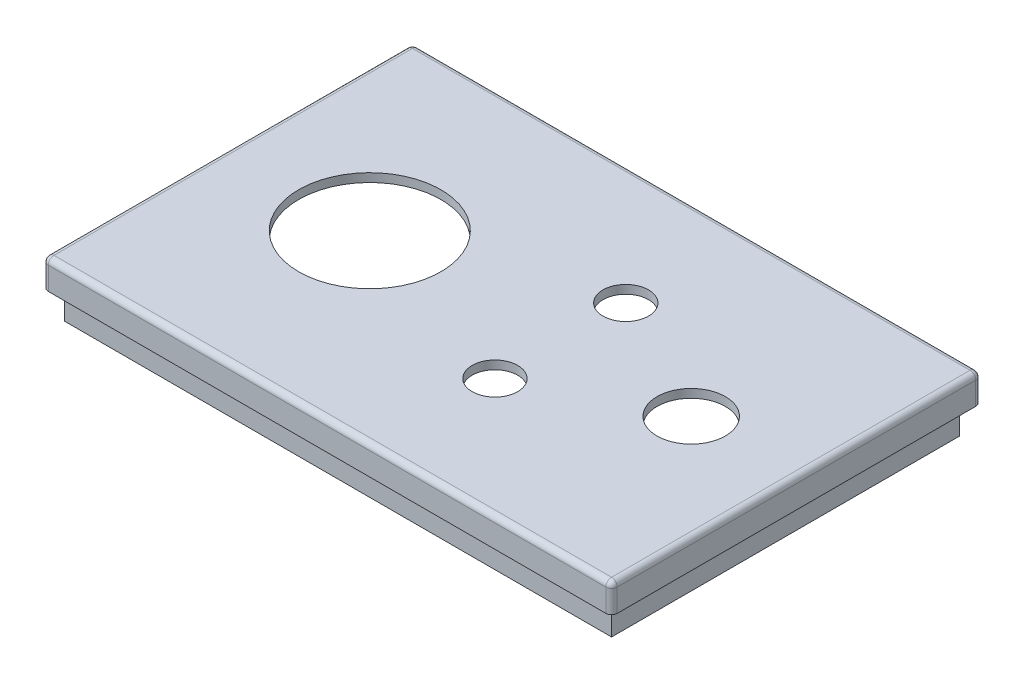
ISO-10303-21;
HEADER;
FILE_DESCRIPTION(('STEP AP214'),'2;1');
FILE_NAME('part.step','',(''),(''),'','','');
FILE_SCHEMA(('AUTOMOTIVE_DESIGN { 1 0 10303 214 1 1 1 1 }'));
ENDSEC;
DATA;
#1=APPLICATION_CONTEXT('core data for automotive mechanical design processes');
#2=APPLICATION_PROTOCOL_DEFINITION('international standard','automotive_design',2000,#1);
#3=PRODUCT_CONTEXT('',#1,'mechanical');
#4=PRODUCT('Part','Part','',(#3));
#5=PRODUCT_RELATED_PRODUCT_CATEGORY('part','',(#4));
#6=PRODUCT_DEFINITION_FORMATION('','',#4);
#7=PRODUCT_DEFINITION_CONTEXT('part definition',#1,'design');
#8=PRODUCT_DEFINITION('design','',#6,#7);
#9=PRODUCT_DEFINITION_SHAPE('','',#8);
#10=(LENGTH_UNIT() NAMED_UNIT(*) SI_UNIT(.MILLI.,.METRE.));
#11=(NAMED_UNIT(*) PLANE_ANGLE_UNIT() SI_UNIT($,.RADIAN.));
#12=(NAMED_UNIT(*) SI_UNIT($,.STERADIAN.) SOLID_ANGLE_UNIT());
#13=UNCERTAINTY_MEASURE_WITH_UNIT(LENGTH_MEASURE(1.E-05),#10,'distance_accuracy_value','');
#14=(GEOMETRIC_REPRESENTATION_CONTEXT(3) GLOBAL_UNCERTAINTY_ASSIGNED_CONTEXT((#13)) GLOBAL_UNIT_ASSIGNED_CONTEXT((#10,
#11,#12)) REPRESENTATION_CONTEXT('',''));
#15=CARTESIAN_POINT('',(0.,0.,0.));
#16=DIRECTION('',(0.,0.,1.));
#17=DIRECTION('',(1.,0.,0.));
#18=AXIS2_PLACEMENT_3D('',#15,#16,#17);
#19=CARTESIAN_POINT('',(0.,70.,0.));
#20=DIRECTION('',(0.,1.,0.));
#21=DIRECTION('',(0.,0.,1.));
#22=AXIS2_PLACEMENT_3D('',#19,#20,#21);
#23=PLANE('',#22);
#24=DIRECTION('',(-1.,0.,0.));
#25=VECTOR('',#24,1.);
#26=CARTESIAN_POINT('',(-47.0604562737643,70.,-39.1555133079848));
#27=LINE('',#26,#25);
#28=CARTESIAN_POINT('',(47.5395437262358,70.,-39.1555133079848));
#29=VERTEX_POINT('',#28);
#30=CARTESIAN_POINT('',(-45.0604562737643,70.,-39.1555133079848));
#31=VERTEX_POINT('',#30);
#32=EDGE_CURVE('E208',#29,#31,#27,.T.);
#33=ORIENTED_EDGE('',*,*,#32,.T.);
#34=DIRECTION('',(0.,0.,1.));
#35=VECTOR('',#34,1.);
#36=CARTESIAN_POINT('',(-45.0604562737643,70.,-41.1555133079848));
#37=LINE('',#36,#35);
#38=CARTESIAN_POINT('',(-45.0604562737643,70.,18.4444866920152));
#39=VERTEX_POINT('',#38);
#40=EDGE_CURVE('E196',#31,#39,#37,.T.);
#41=ORIENTED_EDGE('',*,*,#40,.T.);
#42=DIRECTION('',(1.,0.,0.));
#43=VECTOR('',#42,1.);
#44=CARTESIAN_POINT('',(-47.0604562737643,70.,18.4444866920152));
#45=LINE('',#44,#43);
#46=CARTESIAN_POINT('',(47.5395437262358,70.,18.4444866920152));
#47=VERTEX_POINT('',#46);
#48=EDGE_CURVE('E202',#39,#47,#45,.T.);
#49=ORIENTED_EDGE('',*,*,#48,.T.);
#50=DIRECTION('',(0.,0.,-1.));
#51=VECTOR('',#50,1.);
#52=CARTESIAN_POINT('',(47.5395437262358,70.,-41.1555133079848));
#53=LINE('',#52,#51);
#54=EDGE_CURVE('E205',#47,#29,#53,.T.);
#55=ORIENTED_EDGE('',*,*,#54,.T.);
#56=EDGE_LOOP('',(#33,#41,#49,#55));
#57=FACE_BOUND('',#56,.T.);
#58=DIRECTION('',(0.,0.,-1.));
#59=VECTOR('',#58,1.);
#60=CARTESIAN_POINT('',(-46.8604562737643,70.,20.2444866920152));
#61=LINE('',#60,#59);
#62=CARTESIAN_POINT('',(-46.8604562737643,70.,20.2444866920152));
#63=VERTEX_POINT('',#62);
#64=CARTESIAN_POINT('',(-46.8604562737643,70.,-40.9555133079848));
#65=VERTEX_POINT('',#64);
#66=EDGE_CURVE('E191',#63,#65,#61,.T.);
#67=ORIENTED_EDGE('',*,*,#66,.T.);
#68=DIRECTION('',(1.,0.,0.));
#69=VECTOR('',#68,1.);
#70=CARTESIAN_POINT('',(-46.8604562737643,70.,-40.9555133079848));
#71=LINE('',#70,#69);
#72=CARTESIAN_POINT('',(49.3395437262358,70.,-40.9555133079848));
#73=VERTEX_POINT('',#72);
#74=EDGE_CURVE('E166',#65,#73,#71,.T.);
#75=ORIENTED_EDGE('',*,*,#74,.T.);
#76=DIRECTION('',(0.,0.,1.));
#77=VECTOR('',#76,1.);
#78=CARTESIAN_POINT('',(49.3395437262358,70.,20.2444866920152));
#79=LINE('',#78,#77);
#80=CARTESIAN_POINT('',(49.3395437262358,70.,20.2444866920152));
#81=VERTEX_POINT('',#80);
#82=EDGE_CURVE('E50',#73,#81,#79,.T.);
#83=ORIENTED_EDGE('',*,*,#82,.T.);
#84=DIRECTION('',(-1.,0.,0.));
#85=VECTOR('',#84,1.);
#86=CARTESIAN_POINT('',(-46.8604562737643,70.,20.2444866920152));
#87=LINE('',#86,#85);
#88=EDGE_CURVE('E184',#81,#63,#87,.T.);
#89=ORIENTED_EDGE('',*,*,#88,.T.);
#90=EDGE_LOOP('',(#67,#75,#83,#89));
#91=FACE_BOUND('',#90,.T.);
#92=ADVANCED_FACE('F33',(#57,#91),#23,.F.);
#93=CARTESIAN_POINT('',(0.,75.,0.));
#94=DIRECTION('',(0.,1.,0.));
#95=DIRECTION('',(0.,0.,1.));
#96=AXIS2_PLACEMENT_3D('',#93,#94,#95);
#97=PLANE('',#96);
#98=CARTESIAN_POINT('',(-47.7604562737643,75.,21.1444866920152));
#99=DIRECTION('',(0.,1.,0.));
#100=DIRECTION('',(0.,0.,1.));
#101=AXIS2_PLACEMENT_3D('',#98,#99,#100);
#102=CIRCLE('',#101,1.);
#103=CARTESIAN_POINT('',(-47.7604562737643,75.,22.1444866920152));
#104=VERTEX_POINT('',#103);
#105=CARTESIAN_POINT('',(-48.7604562737643,75.,21.1444866920152));
#106=VERTEX_POINT('',#105);
#107=EDGE_CURVE('E37',#104,#106,#102,.F.);
#108=ORIENTED_EDGE('',*,*,#107,.T.);
#109=DIRECTION('',(0.,0.,1.));
#110=VECTOR('',#109,1.);
#111=CARTESIAN_POINT('',(-48.7604562737643,75.,-42.8555133079848));
#112=LINE('',#111,#110);
#113=CARTESIAN_POINT('',(-48.7604562737643,75.,-41.8555133079848));
#114=VERTEX_POINT('',#113);
#115=EDGE_CURVE('E327',#114,#106,#112,.T.);
#116=ORIENTED_EDGE('',*,*,#115,.F.);
#117=CARTESIAN_POINT('',(-47.7604562737643,75.,-41.8555133079848));
#118=DIRECTION('',(0.,1.,0.));
#119=DIRECTION('',(0.,0.,1.));
#120=AXIS2_PLACEMENT_3D('',#117,#118,#119);
#121=CIRCLE('',#120,1.);
#122=CARTESIAN_POINT('',(-47.7604562737643,75.,-42.8555133079848));
#123=VERTEX_POINT('',#122);
#124=EDGE_CURVE('E330',#114,#123,#121,.F.);
#125=ORIENTED_EDGE('',*,*,#124,.T.);
#126=DIRECTION('',(-1.,0.,0.));
#127=VECTOR('',#126,1.);
#128=CARTESIAN_POINT('',(-48.7604562737643,75.,-42.8555133079848));
#129=LINE('',#128,#127);
#130=CARTESIAN_POINT('',(50.2395437262357,75.,-42.8555133079848));
#131=VERTEX_POINT('',#130);
#132=EDGE_CURVE('E291',#131,#123,#129,.T.);
#133=ORIENTED_EDGE('',*,*,#132,.F.);
#134=CARTESIAN_POINT('',(50.2395437262357,75.,-41.8555133079848));
#135=DIRECTION('',(0.,1.,0.));
#136=DIRECTION('',(0.,0.,1.));
#137=AXIS2_PLACEMENT_3D('',#134,#135,#136);
#138=CIRCLE('',#137,1.);
#139=CARTESIAN_POINT('',(51.2395437262357,75.,-41.8555133079848));
#140=VERTEX_POINT('',#139);
#141=EDGE_CURVE('E11',#131,#140,#138,.F.);
#142=ORIENTED_EDGE('',*,*,#141,.T.);
#143=DIRECTION('',(0.,0.,-1.));
#144=VECTOR('',#143,1.);
#145=CARTESIAN_POINT('',(51.2395437262357,75.,-42.8555133079848));
#146=LINE('',#145,#144);
#147=CARTESIAN_POINT('',(51.2395437262358,75.,21.1444866920152));
#148=VERTEX_POINT('',#147);
#149=EDGE_CURVE('E325',#148,#140,#146,.T.);
#150=ORIENTED_EDGE('',*,*,#149,.F.);
#151=CARTESIAN_POINT('',(50.2395437262358,75.,21.1444866920152));
#152=DIRECTION('',(0.,1.,0.));
#153=DIRECTION('',(0.,0.,1.));
#154=AXIS2_PLACEMENT_3D('',#151,#152,#153);
#155=CIRCLE('',#154,1.);
#156=CARTESIAN_POINT('',(50.2395437262358,75.,22.1444866920152));
#157=VERTEX_POINT('',#156);
#158=EDGE_CURVE('E42',#148,#157,#155,.F.);
#159=ORIENTED_EDGE('',*,*,#158,.T.);
#160=DIRECTION('',(1.,0.,0.));
#161=VECTOR('',#160,1.);
#162=CARTESIAN_POINT('',(-48.7604562737643,75.,22.1444866920152));
#163=LINE('',#162,#161);
#164=EDGE_CURVE('E333',#104,#157,#163,.T.);
#165=ORIENTED_EDGE('',*,*,#164,.F.);
#166=EDGE_LOOP('',(#108,#116,#125,#133,#142,#150,#159,#165));
#167=FACE_BOUND('',#166,.T.);
#168=DIRECTION('',(-1.,0.,0.));
#169=VECTOR('',#168,1.);
#170=CARTESIAN_POINT('',(-46.8604562737643,75.,20.2444866920152));
#171=LINE('',#170,#169);
#172=CARTESIAN_POINT('',(49.3395437262358,75.,20.2444866920152));
#173=VERTEX_POINT('',#172);
#174=CARTESIAN_POINT('',(-46.8604562737643,75.,20.2444866920152));
#175=VERTEX_POINT('',#174);
#176=EDGE_CURVE('E172',#173,#175,#171,.T.);
#177=ORIENTED_EDGE('',*,*,#176,.F.);
#178=DIRECTION('',(0.,0.,1.));
#179=VECTOR('',#178,1.);
#180=CARTESIAN_POINT('',(49.3395437262358,75.,20.2444866920152));
#181=LINE('',#180,#179);
#182=CARTESIAN_POINT('',(49.3395437262358,75.,-40.9555133079848));
#183=VERTEX_POINT('',#182);
#184=EDGE_CURVE('E180',#183,#173,#181,.T.);
#185=ORIENTED_EDGE('',*,*,#184,.F.);
#186=DIRECTION('',(1.,0.,0.));
#187=VECTOR('',#186,1.);
#188=CARTESIAN_POINT('',(-46.8604562737643,75.,-40.9555133079848));
#189=LINE('',#188,#187);
#190=CARTESIAN_POINT('',(-46.8604562737643,75.,-40.9555133079848));
#191=VERTEX_POINT('',#190);
#192=EDGE_CURVE('E164',#191,#183,#189,.T.);
#193=ORIENTED_EDGE('',*,*,#192,.F.);
#194=DIRECTION('',(0.,0.,-1.));
#195=VECTOR('',#194,1.);
#196=CARTESIAN_POINT('',(-46.8604562737643,75.,20.2444866920152));
#197=LINE('',#196,#195);
#198=EDGE_CURVE('E177',#175,#191,#197,.T.);
#199=ORIENTED_EDGE('',*,*,#198,.F.);
#200=EDGE_LOOP('',(#177,#185,#193,#199));
#201=FACE_BOUND('',#200,.T.);
#202=ADVANCED_FACE('F35',(#167,#201),#97,.F.);
#203=CARTESIAN_POINT('',(-48.7604562737643,80.,22.1444866920152));
#204=DIRECTION('',(0.,0.,-1.));
#205=DIRECTION('',(-1.,0.,0.));
#206=AXIS2_PLACEMENT_3D('',#203,#204,#205);
#207=PLANE('',#206);
#208=DIRECTION('',(0.,-1.,0.));
#209=VECTOR('',#208,1.);
#210=CARTESIAN_POINT('',(-47.7604562737643,80.,22.1444866920152));
#211=LINE('',#210,#209);
#212=CARTESIAN_POINT('',(-47.7604562737643,79.,22.1444866920152));
#213=VERTEX_POINT('',#212);
#214=EDGE_CURVE('E284',#213,#104,#211,.T.);
#215=ORIENTED_EDGE('',*,*,#214,.T.);
#216=ORIENTED_EDGE('',*,*,#164,.T.);
#217=DIRECTION('',(0.,-1.,0.));
#218=VECTOR('',#217,1.);
#219=CARTESIAN_POINT('',(50.2395437262358,80.,22.1444866920152));
#220=LINE('',#219,#218);
#221=CARTESIAN_POINT('',(50.2395437262358,79.,22.1444866920152));
#222=VERTEX_POINT('',#221);
#223=EDGE_CURVE('E289',#157,#222,#220,.F.);
#224=ORIENTED_EDGE('',*,*,#223,.T.);
#225=DIRECTION('',(1.,0.,0.));
#226=VECTOR('',#225,1.);
#227=CARTESIAN_POINT('',(-48.7604562737643,79.,22.1444866920152));
#228=LINE('',#227,#226);
#229=EDGE_CURVE('E287',#222,#213,#228,.F.);
#230=ORIENTED_EDGE('',*,*,#229,.T.);
#231=EDGE_LOOP('',(#215,#216,#224,#230));
#232=FACE_BOUND('',#231,.T.);
#233=ADVANCED_FACE('F387',(#232),#207,.F.);
#234=CARTESIAN_POINT('',(0.,80.,0.));
#235=DIRECTION('',(0.,1.,0.));
#236=DIRECTION('',(0.,0.,1.));
#237=AXIS2_PLACEMENT_3D('',#234,#235,#236);
#238=PLANE('',#237);
#239=CARTESIAN_POINT('',(9.73954372623576,80.,1.14448669));
#240=DIRECTION('',(0.,1.,0.));
#241=DIRECTION('',(0.,0.,1.));
#242=AXIS2_PLACEMENT_3D('',#239,#240,#241);
#243=CIRCLE('',#242,4.);
#244=CARTESIAN_POINT('',(9.73954372623576,80.,5.14448669));
#245=VERTEX_POINT('',#244);
#246=EDGE_CURVE('E216',#245,#245,#243,.T.);
#247=ORIENTED_EDGE('',*,*,#246,.F.);
#248=EDGE_LOOP('',(#247));
#249=FACE_BOUND('',#248,.T.);
#250=CARTESIAN_POINT('',(9.73954372623576,80.,-21.85551331));
#251=DIRECTION('',(0.,1.,0.));
#252=DIRECTION('',(0.,0.,1.));
#253=AXIS2_PLACEMENT_3D('',#250,#251,#252);
#254=CIRCLE('',#253,4.);
#255=CARTESIAN_POINT('',(9.73954372623576,80.,-17.85551331));
#256=VERTEX_POINT('',#255);
#257=EDGE_CURVE('E211',#256,#256,#254,.T.);
#258=ORIENTED_EDGE('',*,*,#257,.F.);
#259=EDGE_LOOP('',(#258));
#260=FACE_BOUND('',#259,.T.);
#261=CARTESIAN_POINT('',(-23.7604562737643,80.,-10.3555133079848));
#262=DIRECTION('',(0.,1.,0.));
#263=DIRECTION('',(0.,0.,1.));
#264=AXIS2_PLACEMENT_3D('',#261,#262,#263);
#265=CIRCLE('',#264,12.5);
#266=CARTESIAN_POINT('',(-23.7604562737643,80.,2.14448669201522));
#267=VERTEX_POINT('',#266);
#268=EDGE_CURVE('E228',#267,#267,#265,.T.);
#269=ORIENTED_EDGE('',*,*,#268,.F.);
#270=EDGE_LOOP('',(#269));
#271=FACE_BOUND('',#270,.T.);
#272=CARTESIAN_POINT('',(32.7395437262358,80.,-10.3555133079848));
#273=DIRECTION('',(0.,1.,0.));
#274=DIRECTION('',(0.,0.,1.));
#275=AXIS2_PLACEMENT_3D('',#272,#273,#274);
#276=CIRCLE('',#275,5.99999999999999);
#277=CARTESIAN_POINT('',(32.7395437262358,80.,-4.35551330798479));
#278=VERTEX_POINT('',#277);
#279=EDGE_CURVE('E215',#278,#278,#276,.T.);
#280=ORIENTED_EDGE('',*,*,#279,.F.);
#281=EDGE_LOOP('',(#280));
#282=FACE_BOUND('',#281,.T.);
#283=DIRECTION('',(1.,0.,0.));
#284=VECTOR('',#283,1.);
#285=CARTESIAN_POINT('',(51.2395437262358,80.,21.1444866920152));
#286=LINE('',#285,#284);
#287=CARTESIAN_POINT('',(-47.7604562737643,80.,21.1444866920152));
#288=VERTEX_POINT('',#287);
#289=CARTESIAN_POINT('',(50.2395437262358,80.,21.1444866920152));
#290=VERTEX_POINT('',#289);
#291=EDGE_CURVE('E248',#288,#290,#286,.T.);
#292=ORIENTED_EDGE('',*,*,#291,.T.);
#293=DIRECTION('',(0.,0.,-1.));
#294=VECTOR('',#293,1.);
#295=CARTESIAN_POINT('',(50.2395437262357,80.,-42.8555133079848));
#296=LINE('',#295,#294);
#297=CARTESIAN_POINT('',(50.2395437262357,80.,-41.8555133079848));
#298=VERTEX_POINT('',#297);
#299=EDGE_CURVE('E259',#290,#298,#296,.T.);
#300=ORIENTED_EDGE('',*,*,#299,.T.);
#301=DIRECTION('',(-1.,0.,0.));
#302=VECTOR('',#301,1.);
#303=CARTESIAN_POINT('',(-48.7604562737643,80.,-41.8555133079848));
#304=LINE('',#303,#302);
#305=CARTESIAN_POINT('',(-47.7604562737643,80.,-41.8555133079848));
#306=VERTEX_POINT('',#305);
#307=EDGE_CURVE('E257',#298,#306,#304,.T.);
#308=ORIENTED_EDGE('',*,*,#307,.T.);
#309=DIRECTION('',(0.,0.,1.));
#310=VECTOR('',#309,1.);
#311=CARTESIAN_POINT('',(-47.7604562737643,80.,22.1444866920152));
#312=LINE('',#311,#310);
#313=EDGE_CURVE('E255',#306,#288,#312,.T.);
#314=ORIENTED_EDGE('',*,*,#313,.T.);
#315=EDGE_LOOP('',(#292,#300,#308,#314));
#316=FACE_BOUND('',#315,.T.);
#317=ADVANCED_FACE('F448',(#249,#260,#271,#282,#316),#238,.T.);
#318=CARTESIAN_POINT('',(-48.7604562737643,80.,-42.8555133079848));
#319=DIRECTION('',(1.,0.,0.));
#320=DIRECTION('',(0.,0.,-1.));
#321=AXIS2_PLACEMENT_3D('',#318,#319,#320);
#322=PLANE('',#321);
#323=DIRECTION('',(0.,-1.,0.));
#324=VECTOR('',#323,1.);
#325=CARTESIAN_POINT('',(-48.7604562737643,80.,-41.8555133079848));
#326=LINE('',#325,#324);
#327=CARTESIAN_POINT('',(-48.7604562737643,79.,-41.8555133079848));
#328=VERTEX_POINT('',#327);
#329=EDGE_CURVE('E277',#328,#114,#326,.T.);
#330=ORIENTED_EDGE('',*,*,#329,.T.);
#331=ORIENTED_EDGE('',*,*,#115,.T.);
#332=DIRECTION('',(0.,-1.,0.));
#333=VECTOR('',#332,1.);
#334=CARTESIAN_POINT('',(-48.7604562737643,80.,21.1444866920152));
#335=LINE('',#334,#333);
#336=CARTESIAN_POINT('',(-48.7604562737643,79.,21.1444866920152));
#337=VERTEX_POINT('',#336);
#338=EDGE_CURVE('E282',#106,#337,#335,.F.);
#339=ORIENTED_EDGE('',*,*,#338,.T.);
#340=DIRECTION('',(0.,0.,1.));
#341=VECTOR('',#340,1.);
#342=CARTESIAN_POINT('',(-48.7604562737643,79.,-42.8555133079848));
#343=LINE('',#342,#341);
#344=EDGE_CURVE('E280',#337,#328,#343,.F.);
#345=ORIENTED_EDGE('',*,*,#344,.T.);
#346=EDGE_LOOP('',(#330,#331,#339,#345));
#347=FACE_BOUND('',#346,.T.);
#348=ADVANCED_FACE('F346',(#347),#322,.F.);
#349=CARTESIAN_POINT('',(51.2395437262357,80.,-42.8555133079848));
#350=DIRECTION('',(-1.,0.,0.));
#351=DIRECTION('',(0.,0.,1.));
#352=AXIS2_PLACEMENT_3D('',#349,#350,#351);
#353=PLANE('',#352);
#354=DIRECTION('',(0.,-1.,0.));
#355=VECTOR('',#354,1.);
#356=CARTESIAN_POINT('',(51.2395437262358,80.,21.1444866920152));
#357=LINE('',#356,#355);
#358=CARTESIAN_POINT('',(51.2395437262358,79.,21.1444866920152));
#359=VERTEX_POINT('',#358);
#360=EDGE_CURVE('E267',#359,#148,#357,.T.);
#361=ORIENTED_EDGE('',*,*,#360,.T.);
#362=ORIENTED_EDGE('',*,*,#149,.T.);
#363=DIRECTION('',(0.,-1.,0.));
#364=VECTOR('',#363,1.);
#365=CARTESIAN_POINT('',(51.2395437262357,80.,-41.8555133079848));
#366=LINE('',#365,#364);
#367=CARTESIAN_POINT('',(51.2395437262357,79.,-41.8555133079848));
#368=VERTEX_POINT('',#367);
#369=EDGE_CURVE('E262',#140,#368,#366,.F.);
#370=ORIENTED_EDGE('',*,*,#369,.T.);
#371=DIRECTION('',(0.,0.,-1.));
#372=VECTOR('',#371,1.);
#373=CARTESIAN_POINT('',(51.2395437262358,79.,22.1444866920152));
#374=LINE('',#373,#372);
#375=EDGE_CURVE('E264',#368,#359,#374,.F.);
#376=ORIENTED_EDGE('',*,*,#375,.T.);
#377=EDGE_LOOP('',(#361,#362,#370,#376));
#378=FACE_BOUND('',#377,.T.);
#379=ADVANCED_FACE('F380',(#378),#353,.F.);
#380=CARTESIAN_POINT('',(-48.7604562737643,80.,-42.8555133079848));
#381=DIRECTION('',(0.,0.,1.));
#382=DIRECTION('',(1.,0.,0.));
#383=AXIS2_PLACEMENT_3D('',#380,#381,#382);
#384=PLANE('',#383);
#385=DIRECTION('',(0.,-1.,0.));
#386=VECTOR('',#385,1.);
#387=CARTESIAN_POINT('',(50.2395437262357,80.,-42.8555133079848));
#388=LINE('',#387,#386);
#389=CARTESIAN_POINT('',(50.2395437262357,79.,-42.8555133079848));
#390=VERTEX_POINT('',#389);
#391=EDGE_CURVE('E270',#390,#131,#388,.T.);
#392=ORIENTED_EDGE('',*,*,#391,.T.);
#393=ORIENTED_EDGE('',*,*,#132,.T.);
#394=DIRECTION('',(0.,-1.,0.));
#395=VECTOR('',#394,1.);
#396=CARTESIAN_POINT('',(-47.7604562737643,80.,-42.8555133079848));
#397=LINE('',#396,#395);
#398=CARTESIAN_POINT('',(-47.7604562737643,79.,-42.8555133079848));
#399=VERTEX_POINT('',#398);
#400=EDGE_CURVE('E275',#123,#399,#397,.F.);
#401=ORIENTED_EDGE('',*,*,#400,.T.);
#402=DIRECTION('',(-1.,0.,0.));
#403=VECTOR('',#402,1.);
#404=CARTESIAN_POINT('',(51.2395437262357,79.,-42.8555133079848));
#405=LINE('',#404,#403);
#406=EDGE_CURVE('E273',#399,#390,#405,.F.);
#407=ORIENTED_EDGE('',*,*,#406,.T.);
#408=EDGE_LOOP('',(#392,#393,#401,#407));
#409=FACE_BOUND('',#408,.T.);
#410=ADVANCED_FACE('F364',(#409),#384,.F.);
#411=CARTESIAN_POINT('',(0.,78.5,0.));
#412=DIRECTION('',(0.,1.,0.));
#413=DIRECTION('',(0.,0.,1.));
#414=AXIS2_PLACEMENT_3D('',#411,#412,#413);
#415=PLANE('',#414);
#416=CARTESIAN_POINT('',(9.73954372623576,78.5,1.14448669));
#417=DIRECTION('',(0.,1.,0.));
#418=DIRECTION('',(0.,0.,1.));
#419=AXIS2_PLACEMENT_3D('',#416,#417,#418);
#420=CIRCLE('',#419,4.);
#421=CARTESIAN_POINT('',(9.73954372623576,78.5,5.14448669));
#422=VERTEX_POINT('',#421);
#423=EDGE_CURVE('E212',#422,#422,#420,.T.);
#424=ORIENTED_EDGE('',*,*,#423,.T.);
#425=EDGE_LOOP('',(#424));
#426=FACE_BOUND('',#425,.T.);
#427=CARTESIAN_POINT('',(9.73954372623576,78.5,-21.85551331));
#428=DIRECTION('',(0.,1.,0.));
#429=DIRECTION('',(0.,0.,1.));
#430=AXIS2_PLACEMENT_3D('',#427,#428,#429);
#431=CIRCLE('',#430,4.);
#432=CARTESIAN_POINT('',(9.73954372623576,78.5,-17.85551331));
#433=VERTEX_POINT('',#432);
#434=EDGE_CURVE('E219',#433,#433,#431,.T.);
#435=ORIENTED_EDGE('',*,*,#434,.T.);
#436=EDGE_LOOP('',(#435));
#437=FACE_BOUND('',#436,.T.);
#438=CARTESIAN_POINT('',(-23.7604562737643,78.5,-10.3555133079848));
#439=DIRECTION('',(0.,1.,0.));
#440=DIRECTION('',(0.,0.,1.));
#441=AXIS2_PLACEMENT_3D('',#438,#439,#440);
#442=CIRCLE('',#441,12.5);
#443=CARTESIAN_POINT('',(-23.7604562737643,78.5,2.14448669201522));
#444=VERTEX_POINT('',#443);
#445=EDGE_CURVE('E224',#444,#444,#442,.T.);
#446=ORIENTED_EDGE('',*,*,#445,.T.);
#447=EDGE_LOOP('',(#446));
#448=FACE_BOUND('',#447,.T.);
#449=CARTESIAN_POINT('',(32.7395437262358,78.5,-10.3555133079848));
#450=DIRECTION('',(0.,1.,0.));
#451=DIRECTION('',(0.,0.,1.));
#452=AXIS2_PLACEMENT_3D('',#449,#450,#451);
#453=CIRCLE('',#452,5.99999999999999);
#454=CARTESIAN_POINT('',(32.7395437262358,78.5,-4.35551330798479));
#455=VERTEX_POINT('',#454);
#456=EDGE_CURVE('E231',#455,#455,#453,.T.);
#457=ORIENTED_EDGE('',*,*,#456,.T.);
#458=EDGE_LOOP('',(#457));
#459=FACE_BOUND('',#458,.T.);
#460=DIRECTION('',(-1.,0.,0.));
#461=VECTOR('',#460,1.);
#462=CARTESIAN_POINT('',(47.5395437262358,78.5,18.4444866920152));
#463=LINE('',#462,#461);
#464=CARTESIAN_POINT('',(47.5395437262358,78.5,18.4444866920152));
#465=VERTEX_POINT('',#464);
#466=CARTESIAN_POINT('',(-45.0604562737642,78.5,18.4444866920152));
#467=VERTEX_POINT('',#466);
#468=EDGE_CURVE('E246',#465,#467,#463,.T.);
#469=ORIENTED_EDGE('',*,*,#468,.T.);
#470=DIRECTION('',(0.,0.,-1.));
#471=VECTOR('',#470,1.);
#472=CARTESIAN_POINT('',(-45.0604562737642,78.5,-39.1555133079848));
#473=LINE('',#472,#471);
#474=CARTESIAN_POINT('',(-45.0604562737642,78.5,-39.1555133079848));
#475=VERTEX_POINT('',#474);
#476=EDGE_CURVE('E249',#467,#475,#473,.T.);
#477=ORIENTED_EDGE('',*,*,#476,.T.);
#478=DIRECTION('',(1.,0.,0.));
#479=VECTOR('',#478,1.);
#480=CARTESIAN_POINT('',(47.5395437262358,78.5,-39.1555133079848));
#481=LINE('',#480,#479);
#482=CARTESIAN_POINT('',(47.5395437262358,78.5,-39.1555133079848));
#483=VERTEX_POINT('',#482);
#484=EDGE_CURVE('E251',#475,#483,#481,.T.);
#485=ORIENTED_EDGE('',*,*,#484,.T.);
#486=DIRECTION('',(0.,0.,1.));
#487=VECTOR('',#486,1.);
#488=CARTESIAN_POINT('',(47.5395437262358,78.5,-39.1555133079848));
#489=LINE('',#488,#487);
#490=EDGE_CURVE('E244',#483,#465,#489,.T.);
#491=ORIENTED_EDGE('',*,*,#490,.T.);
#492=EDGE_LOOP('',(#469,#477,#485,#491));
#493=FACE_BOUND('',#492,.T.);
#494=ADVANCED_FACE('F432',(#426,#437,#448,#459,#493),#415,.F.);
#495=CARTESIAN_POINT('',(47.5395437262358,80.002,-39.1555133079848));
#496=DIRECTION('',(1.,0.,0.));
#497=DIRECTION('',(0.,0.,-1.));
#498=AXIS2_PLACEMENT_3D('',#495,#496,#497);
#499=PLANE('',#498);
#500=DIRECTION('',(0.,-1.,0.));
#501=VECTOR('',#500,1.);
#502=CARTESIAN_POINT('',(47.5395437262358,80.002,-39.1555133079848));
#503=LINE('',#502,#501);
#504=EDGE_CURVE('E242',#483,#29,#503,.T.);
#505=ORIENTED_EDGE('',*,*,#504,.T.);
#506=ORIENTED_EDGE('',*,*,#54,.F.);
#507=DIRECTION('',(0.,-1.,0.));
#508=VECTOR('',#507,1.);
#509=CARTESIAN_POINT('',(47.5395437262358,80.002,18.4444866920152));
#510=LINE('',#509,#508);
#511=EDGE_CURVE('E236',#465,#47,#510,.T.);
#512=ORIENTED_EDGE('',*,*,#511,.F.);
#513=ORIENTED_EDGE('',*,*,#490,.F.);
#514=EDGE_LOOP('',(#505,#506,#512,#513));
#515=FACE_BOUND('',#514,.T.);
#516=ADVANCED_FACE('F428',(#515),#499,.F.);
#517=CARTESIAN_POINT('',(47.5395437262358,80.002,-39.1555133079848));
#518=DIRECTION('',(0.,0.,-1.));
#519=DIRECTION('',(-1.,0.,0.));
#520=AXIS2_PLACEMENT_3D('',#517,#518,#519);
#521=PLANE('',#520);
#522=DIRECTION('',(0.,-1.,0.));
#523=VECTOR('',#522,1.);
#524=CARTESIAN_POINT('',(-45.0604562737642,80.002,-39.1555133079848));
#525=LINE('',#524,#523);
#526=EDGE_CURVE('E241',#475,#31,#525,.T.);
#527=ORIENTED_EDGE('',*,*,#526,.T.);
#528=ORIENTED_EDGE('',*,*,#32,.F.);
#529=ORIENTED_EDGE('',*,*,#504,.F.);
#530=ORIENTED_EDGE('',*,*,#484,.F.);
#531=EDGE_LOOP('',(#527,#528,#529,#530));
#532=FACE_BOUND('',#531,.T.);
#533=ADVANCED_FACE('F431',(#532),#521,.F.);
#534=CARTESIAN_POINT('',(-45.0604562737642,80.002,-39.1555133079848));
#535=DIRECTION('',(-1.,0.,0.));
#536=DIRECTION('',(0.,0.,1.));
#537=AXIS2_PLACEMENT_3D('',#534,#535,#536);
#538=PLANE('',#537);
#539=DIRECTION('',(0.,-1.,0.));
#540=VECTOR('',#539,1.);
#541=CARTESIAN_POINT('',(-45.0604562737642,80.002,18.4444866920152));
#542=LINE('',#541,#540);
#543=EDGE_CURVE('E238',#467,#39,#542,.T.);
#544=ORIENTED_EDGE('',*,*,#543,.T.);
#545=ORIENTED_EDGE('',*,*,#40,.F.);
#546=ORIENTED_EDGE('',*,*,#526,.F.);
#547=ORIENTED_EDGE('',*,*,#476,.F.);
#548=EDGE_LOOP('',(#544,#545,#546,#547));
#549=FACE_BOUND('',#548,.T.);
#550=ADVANCED_FACE('F437',(#549),#538,.F.);
#551=CARTESIAN_POINT('',(47.5395437262358,80.002,18.4444866920152));
#552=DIRECTION('',(0.,0.,1.));
#553=DIRECTION('',(1.,0.,0.));
#554=AXIS2_PLACEMENT_3D('',#551,#552,#553);
#555=PLANE('',#554);
#556=ORIENTED_EDGE('',*,*,#511,.T.);
#557=ORIENTED_EDGE('',*,*,#48,.F.);
#558=ORIENTED_EDGE('',*,*,#543,.F.);
#559=ORIENTED_EDGE('',*,*,#468,.F.);
#560=EDGE_LOOP('',(#556,#557,#558,#559));
#561=FACE_BOUND('',#560,.T.);
#562=ADVANCED_FACE('F434',(#561),#555,.F.);
#563=CARTESIAN_POINT('',(-47.7604562737643,80.,21.1444866920152));
#564=DIRECTION('',(0.,-1.,0.));
#565=DIRECTION('',(0.,0.,-1.));
#566=AXIS2_PLACEMENT_3D('',#563,#564,#565);
#567=CYLINDRICAL_SURFACE('',#566,1.);
#568=ORIENTED_EDGE('',*,*,#107,.F.);
#569=ORIENTED_EDGE('',*,*,#214,.F.);
#570=CARTESIAN_POINT('',(-47.7604562737643,79.,21.1444866920152));
#571=DIRECTION('',(0.,1.,0.));
#572=DIRECTION('',(0.,0.,1.));
#573=AXIS2_PLACEMENT_3D('',#570,#571,#572);
#574=CIRCLE('',#573,1.);
#575=EDGE_CURVE('E239',#337,#213,#574,.T.);
#576=ORIENTED_EDGE('',*,*,#575,.F.);
#577=ORIENTED_EDGE('',*,*,#338,.F.);
#578=EDGE_LOOP('',(#568,#569,#576,#577));
#579=FACE_BOUND('',#578,.T.);
#580=ADVANCED_FACE('F343',(#579),#567,.T.);
#581=CARTESIAN_POINT('',(-47.7604562737643,79.,0.));
#582=DIRECTION('',(0.,0.,-1.));
#583=DIRECTION('',(-1.,0.,0.));
#584=AXIS2_PLACEMENT_3D('',#581,#582,#583);
#585=CYLINDRICAL_SURFACE('',#584,1.);
#586=CARTESIAN_POINT('',(-47.7604562737643,79.,-41.8555133079848));
#587=DIRECTION('',(0.,0.,-1.));
#588=DIRECTION('',(-1.,0.,0.));
#589=AXIS2_PLACEMENT_3D('',#586,#587,#588);
#590=CIRCLE('',#589,1.);
#591=EDGE_CURVE('E316',#328,#306,#590,.T.);
#592=ORIENTED_EDGE('',*,*,#591,.F.);
#593=ORIENTED_EDGE('',*,*,#344,.F.);
#594=CARTESIAN_POINT('',(-47.7604562737643,79.,21.1444866920152));
#595=DIRECTION('',(0.,0.,1.));
#596=DIRECTION('',(1.,0.,0.));
#597=AXIS2_PLACEMENT_3D('',#594,#595,#596);
#598=CIRCLE('',#597,1.);
#599=EDGE_CURVE('E319',#288,#337,#598,.T.);
#600=ORIENTED_EDGE('',*,*,#599,.F.);
#601=ORIENTED_EDGE('',*,*,#313,.F.);
#602=EDGE_LOOP('',(#592,#593,#600,#601));
#603=FACE_BOUND('',#602,.T.);
#604=ADVANCED_FACE('F351',(#603),#585,.T.);
#605=CARTESIAN_POINT('',(-47.7604562737643,80.,-41.8555133079848));
#606=DIRECTION('',(0.,-1.,0.));
#607=DIRECTION('',(0.,0.,-1.));
#608=AXIS2_PLACEMENT_3D('',#605,#606,#607);
#609=CYLINDRICAL_SURFACE('',#608,1.);
#610=ORIENTED_EDGE('',*,*,#124,.F.);
#611=ORIENTED_EDGE('',*,*,#329,.F.);
#612=CARTESIAN_POINT('',(-47.7604562737643,79.,-41.8555133079848));
#613=DIRECTION('',(0.,1.,0.));
#614=DIRECTION('',(0.,0.,1.));
#615=AXIS2_PLACEMENT_3D('',#612,#613,#614);
#616=CIRCLE('',#615,1.);
#617=EDGE_CURVE('E313',#399,#328,#616,.T.);
#618=ORIENTED_EDGE('',*,*,#617,.F.);
#619=ORIENTED_EDGE('',*,*,#400,.F.);
#620=EDGE_LOOP('',(#610,#611,#618,#619));
#621=FACE_BOUND('',#620,.T.);
#622=ADVANCED_FACE('F361',(#621),#609,.T.);
#623=CARTESIAN_POINT('',(-47.7604562737643,79.,21.1444866920152));
#624=DIRECTION('',(-1.,0.,0.));
#625=DIRECTION('',(0.,0.,1.));
#626=AXIS2_PLACEMENT_3D('',#623,#624,#625);
#627=SPHERICAL_SURFACE('',#626,1.);
#628=ORIENTED_EDGE('',*,*,#599,.T.);
#629=ORIENTED_EDGE('',*,*,#575,.T.);
#630=CARTESIAN_POINT('',(-47.7604562737643,79.,21.1444866920152));
#631=DIRECTION('',(-1.,0.,0.));
#632=DIRECTION('',(0.,0.,1.));
#633=AXIS2_PLACEMENT_3D('',#630,#631,#632);
#634=CIRCLE('',#633,1.);
#635=EDGE_CURVE('E310',#288,#213,#634,.F.);
#636=ORIENTED_EDGE('',*,*,#635,.F.);
#637=EDGE_LOOP('',(#628,#629,#636));
#638=FACE_BOUND('',#637,.T.);
#639=ADVANCED_FACE('F393',(#638),#627,.T.);
#640=CARTESIAN_POINT('',(-47.7604562737643,79.,-41.8555133079848));
#641=DIRECTION('',(-1.,0.,0.));
#642=DIRECTION('',(0.,0.,1.));
#643=AXIS2_PLACEMENT_3D('',#640,#641,#642);
#644=SPHERICAL_SURFACE('',#643,1.);
#645=ORIENTED_EDGE('',*,*,#617,.T.);
#646=ORIENTED_EDGE('',*,*,#591,.T.);
#647=CARTESIAN_POINT('',(-47.7604562737643,79.,-41.8555133079848));
#648=DIRECTION('',(-1.,0.,0.));
#649=DIRECTION('',(0.,0.,1.));
#650=AXIS2_PLACEMENT_3D('',#647,#648,#649);
#651=CIRCLE('',#650,1.);
#652=EDGE_CURVE('E307',#399,#306,#651,.F.);
#653=ORIENTED_EDGE('',*,*,#652,.F.);
#654=EDGE_LOOP('',(#645,#646,#653));
#655=FACE_BOUND('',#654,.T.);
#656=ADVANCED_FACE('F357',(#655),#644,.T.);
#657=CARTESIAN_POINT('',(50.2395437262358,80.,21.1444866920152));
#658=DIRECTION('',(0.,-1.,0.));
#659=DIRECTION('',(0.,0.,-1.));
#660=AXIS2_PLACEMENT_3D('',#657,#658,#659);
#661=CYLINDRICAL_SURFACE('',#660,1.);
#662=ORIENTED_EDGE('',*,*,#158,.F.);
#663=ORIENTED_EDGE('',*,*,#360,.F.);
#664=CARTESIAN_POINT('',(50.2395437262358,79.,21.1444866920152));
#665=DIRECTION('',(0.,1.,0.));
#666=DIRECTION('',(0.,0.,1.));
#667=AXIS2_PLACEMENT_3D('',#664,#665,#666);
#668=CIRCLE('',#667,1.);
#669=EDGE_CURVE('E304',#222,#359,#668,.T.);
#670=ORIENTED_EDGE('',*,*,#669,.F.);
#671=ORIENTED_EDGE('',*,*,#223,.F.);
#672=EDGE_LOOP('',(#662,#663,#670,#671));
#673=FACE_BOUND('',#672,.T.);
#674=ADVANCED_FACE('F385',(#673),#661,.T.);
#675=CARTESIAN_POINT('',(0.,79.,21.1444866920152));
#676=DIRECTION('',(-1.,0.,0.));
#677=DIRECTION('',(0.,0.,1.));
#678=AXIS2_PLACEMENT_3D('',#675,#676,#677);
#679=CYLINDRICAL_SURFACE('',#678,1.);
#680=ORIENTED_EDGE('',*,*,#635,.T.);
#681=ORIENTED_EDGE('',*,*,#229,.F.);
#682=CARTESIAN_POINT('',(50.2395437262358,79.,21.1444866920152));
#683=DIRECTION('',(1.,0.,0.));
#684=DIRECTION('',(0.,0.,-1.));
#685=AXIS2_PLACEMENT_3D('',#682,#683,#684);
#686=CIRCLE('',#685,1.);
#687=EDGE_CURVE('E301',#290,#222,#686,.T.);
#688=ORIENTED_EDGE('',*,*,#687,.F.);
#689=ORIENTED_EDGE('',*,*,#291,.F.);
#690=EDGE_LOOP('',(#680,#681,#688,#689));
#691=FACE_BOUND('',#690,.T.);
#692=ADVANCED_FACE('F390',(#691),#679,.T.);
#693=CARTESIAN_POINT('',(0.,79.,-41.8555133079848));
#694=DIRECTION('',(1.,0.,0.));
#695=DIRECTION('',(0.,0.,-1.));
#696=AXIS2_PLACEMENT_3D('',#693,#694,#695);
#697=CYLINDRICAL_SURFACE('',#696,1.);
#698=ORIENTED_EDGE('',*,*,#652,.T.);
#699=ORIENTED_EDGE('',*,*,#307,.F.);
#700=CARTESIAN_POINT('',(50.2395437262357,79.,-41.8555133079848));
#701=DIRECTION('',(1.,0.,0.));
#702=DIRECTION('',(0.,0.,-1.));
#703=AXIS2_PLACEMENT_3D('',#700,#701,#702);
#704=CIRCLE('',#703,1.);
#705=EDGE_CURVE('E298',#390,#298,#704,.T.);
#706=ORIENTED_EDGE('',*,*,#705,.F.);
#707=ORIENTED_EDGE('',*,*,#406,.F.);
#708=EDGE_LOOP('',(#698,#699,#706,#707));
#709=FACE_BOUND('',#708,.T.);
#710=ADVANCED_FACE('F371',(#709),#697,.T.);
#711=CARTESIAN_POINT('',(50.2395437262357,80.,-41.8555133079848));
#712=DIRECTION('',(0.,-1.,0.));
#713=DIRECTION('',(0.,0.,-1.));
#714=AXIS2_PLACEMENT_3D('',#711,#712,#713);
#715=CYLINDRICAL_SURFACE('',#714,1.);
#716=ORIENTED_EDGE('',*,*,#141,.F.);
#717=ORIENTED_EDGE('',*,*,#391,.F.);
#718=CARTESIAN_POINT('',(50.2395437262357,79.,-41.8555133079848));
#719=DIRECTION('',(0.,1.,0.));
#720=DIRECTION('',(0.,0.,1.));
#721=AXIS2_PLACEMENT_3D('',#718,#719,#720);
#722=CIRCLE('',#721,1.);
#723=EDGE_CURVE('E295',#368,#390,#722,.T.);
#724=ORIENTED_EDGE('',*,*,#723,.F.);
#725=ORIENTED_EDGE('',*,*,#369,.F.);
#726=EDGE_LOOP('',(#716,#717,#724,#725));
#727=FACE_BOUND('',#726,.T.);
#728=ADVANCED_FACE('F367',(#727),#715,.T.);
#729=CARTESIAN_POINT('',(50.2395437262358,79.,21.1444866920152));
#730=DIRECTION('',(0.,0.,1.));
#731=DIRECTION('',(1.,0.,0.));
#732=AXIS2_PLACEMENT_3D('',#729,#730,#731);
#733=SPHERICAL_SURFACE('',#732,1.);
#734=ORIENTED_EDGE('',*,*,#687,.T.);
#735=ORIENTED_EDGE('',*,*,#669,.T.);
#736=CARTESIAN_POINT('',(50.2395437262358,79.,21.1444866920152));
#737=DIRECTION('',(0.,0.,1.));
#738=DIRECTION('',(0.,-1.,0.));
#739=AXIS2_PLACEMENT_3D('',#736,#737,#738);
#740=CIRCLE('',#739,1.);
#741=EDGE_CURVE('E293',#290,#359,#740,.F.);
#742=ORIENTED_EDGE('',*,*,#741,.F.);
#743=EDGE_LOOP('',(#734,#735,#742));
#744=FACE_BOUND('',#743,.T.);
#745=ADVANCED_FACE('F464',(#744),#733,.T.);
#746=CARTESIAN_POINT('',(50.2395437262357,79.,-41.8555133079848));
#747=DIRECTION('',(0.,0.,-1.));
#748=DIRECTION('',(-1.,0.,0.));
#749=AXIS2_PLACEMENT_3D('',#746,#747,#748);
#750=SPHERICAL_SURFACE('',#749,1.);
#751=ORIENTED_EDGE('',*,*,#723,.T.);
#752=ORIENTED_EDGE('',*,*,#705,.T.);
#753=CARTESIAN_POINT('',(50.2395437262357,79.,-41.8555133079848));
#754=DIRECTION('',(0.,0.,-1.));
#755=DIRECTION('',(-1.,0.,0.));
#756=AXIS2_PLACEMENT_3D('',#753,#754,#755);
#757=CIRCLE('',#756,1.);
#758=EDGE_CURVE('E227',#368,#298,#757,.F.);
#759=ORIENTED_EDGE('',*,*,#758,.F.);
#760=EDGE_LOOP('',(#751,#752,#759));
#761=FACE_BOUND('',#760,.T.);
#762=ADVANCED_FACE('F374',(#761),#750,.T.);
#763=CARTESIAN_POINT('',(50.2395437262358,79.,0.));
#764=DIRECTION('',(0.,0.,1.));
#765=DIRECTION('',(1.,0.,0.));
#766=AXIS2_PLACEMENT_3D('',#763,#764,#765);
#767=CYLINDRICAL_SURFACE('',#766,1.);
#768=ORIENTED_EDGE('',*,*,#741,.T.);
#769=ORIENTED_EDGE('',*,*,#375,.F.);
#770=ORIENTED_EDGE('',*,*,#758,.T.);
#771=ORIENTED_EDGE('',*,*,#299,.F.);
#772=EDGE_LOOP('',(#768,#769,#770,#771));
#773=FACE_BOUND('',#772,.T.);
#774=ADVANCED_FACE('F377',(#773),#767,.T.);
#775=CARTESIAN_POINT('',(32.7395437262358,78.5,-10.3555133079848));
#776=DIRECTION('',(0.,1.,0.));
#777=DIRECTION('',(0.,0.,1.));
#778=AXIS2_PLACEMENT_3D('',#775,#776,#777);
#779=CYLINDRICAL_SURFACE('',#778,5.99999999999999);
#780=ORIENTED_EDGE('',*,*,#456,.F.);
#781=EDGE_LOOP('',(#780));
#782=FACE_BOUND('',#781,.T.);
#783=ORIENTED_EDGE('',*,*,#279,.T.);
#784=EDGE_LOOP('',(#783));
#785=FACE_BOUND('',#784,.T.);
#786=ADVANCED_FACE('F423',(#782,#785),#779,.F.);
#787=CARTESIAN_POINT('',(-23.7604562737643,78.5,-10.3555133079848));
#788=DIRECTION('',(0.,1.,0.));
#789=DIRECTION('',(0.,0.,1.));
#790=AXIS2_PLACEMENT_3D('',#787,#788,#789);
#791=CYLINDRICAL_SURFACE('',#790,12.5);
#792=ORIENTED_EDGE('',*,*,#445,.F.);
#793=EDGE_LOOP('',(#792));
#794=FACE_BOUND('',#793,.T.);
#795=ORIENTED_EDGE('',*,*,#268,.T.);
#796=EDGE_LOOP('',(#795));
#797=FACE_BOUND('',#796,.T.);
#798=ADVANCED_FACE('F419',(#794,#797),#791,.F.);
#799=CARTESIAN_POINT('',(9.73954372623576,78.5,-21.85551331));
#800=DIRECTION('',(0.,1.,0.));
#801=DIRECTION('',(0.,0.,1.));
#802=AXIS2_PLACEMENT_3D('',#799,#800,#801);
#803=CYLINDRICAL_SURFACE('',#802,4.);
#804=ORIENTED_EDGE('',*,*,#434,.F.);
#805=EDGE_LOOP('',(#804));
#806=FACE_BOUND('',#805,.T.);
#807=ORIENTED_EDGE('',*,*,#257,.T.);
#808=EDGE_LOOP('',(#807));
#809=FACE_BOUND('',#808,.T.);
#810=ADVANCED_FACE('F415',(#806,#809),#803,.F.);
#811=CARTESIAN_POINT('',(9.73954372623576,78.5,1.14448669));
#812=DIRECTION('',(0.,1.,0.));
#813=DIRECTION('',(0.,0.,1.));
#814=AXIS2_PLACEMENT_3D('',#811,#812,#813);
#815=CYLINDRICAL_SURFACE('',#814,4.);
#816=ORIENTED_EDGE('',*,*,#423,.F.);
#817=EDGE_LOOP('',(#816));
#818=FACE_BOUND('',#817,.T.);
#819=ORIENTED_EDGE('',*,*,#246,.T.);
#820=EDGE_LOOP('',(#819));
#821=FACE_BOUND('',#820,.T.);
#822=ADVANCED_FACE('F408',(#818,#821),#815,.F.);
#823=CARTESIAN_POINT('',(-46.8604562737643,75.,20.2444866920152));
#824=DIRECTION('',(-1.,0.,0.));
#825=DIRECTION('',(0.,0.,1.));
#826=AXIS2_PLACEMENT_3D('',#823,#824,#825);
#827=PLANE('',#826);
#828=ORIENTED_EDGE('',*,*,#66,.F.);
#829=DIRECTION('',(0.,-1.,0.));
#830=VECTOR('',#829,1.);
#831=CARTESIAN_POINT('',(-46.8604562737643,75.,20.2444866920152));
#832=LINE('',#831,#830);
#833=EDGE_CURVE('E183',#175,#63,#832,.T.);
#834=ORIENTED_EDGE('',*,*,#833,.F.);
#835=ORIENTED_EDGE('',*,*,#198,.T.);
#836=DIRECTION('',(0.,-1.,0.));
#837=VECTOR('',#836,1.);
#838=CARTESIAN_POINT('',(-46.8604562737643,75.,-40.9555133079848));
#839=LINE('',#838,#837);
#840=EDGE_CURVE('E161',#191,#65,#839,.T.);
#841=ORIENTED_EDGE('',*,*,#840,.T.);
#842=EDGE_LOOP('',(#828,#834,#835,#841));
#843=FACE_BOUND('',#842,.T.);
#844=ADVANCED_FACE('F182',(#843),#827,.T.);
#845=CARTESIAN_POINT('',(-46.8604562737643,75.,20.2444866920152));
#846=DIRECTION('',(0.,0.,1.));
#847=DIRECTION('',(1.,0.,0.));
#848=AXIS2_PLACEMENT_3D('',#845,#846,#847);
#849=PLANE('',#848);
#850=ORIENTED_EDGE('',*,*,#88,.F.);
#851=DIRECTION('',(0.,-1.,0.));
#852=VECTOR('',#851,1.);
#853=CARTESIAN_POINT('',(49.3395437262358,75.,20.2444866920152));
#854=LINE('',#853,#852);
#855=EDGE_CURVE('E197',#173,#81,#854,.T.);
#856=ORIENTED_EDGE('',*,*,#855,.F.);
#857=ORIENTED_EDGE('',*,*,#176,.T.);
#858=ORIENTED_EDGE('',*,*,#833,.T.);
#859=EDGE_LOOP('',(#850,#856,#857,#858));
#860=FACE_BOUND('',#859,.T.);
#861=ADVANCED_FACE('F536',(#860),#849,.T.);
#862=CARTESIAN_POINT('',(49.3395437262358,75.,20.2444866920152));
#863=DIRECTION('',(1.,0.,0.));
#864=DIRECTION('',(0.,0.,-1.));
#865=AXIS2_PLACEMENT_3D('',#862,#863,#864);
#866=PLANE('',#865);
#867=ORIENTED_EDGE('',*,*,#82,.F.);
#868=DIRECTION('',(0.,-1.,0.));
#869=VECTOR('',#868,1.);
#870=CARTESIAN_POINT('',(49.3395437262358,75.,-40.9555133079848));
#871=LINE('',#870,#869);
#872=EDGE_CURVE('E171',#183,#73,#871,.T.);
#873=ORIENTED_EDGE('',*,*,#872,.F.);
#874=ORIENTED_EDGE('',*,*,#184,.T.);
#875=ORIENTED_EDGE('',*,*,#855,.T.);
#876=EDGE_LOOP('',(#867,#873,#874,#875));
#877=FACE_BOUND('',#876,.T.);
#878=ADVANCED_FACE('F543',(#877),#866,.T.);
#879=CARTESIAN_POINT('',(-46.8604562737643,75.,-40.9555133079848));
#880=DIRECTION('',(0.,0.,-1.));
#881=DIRECTION('',(-1.,0.,0.));
#882=AXIS2_PLACEMENT_3D('',#879,#880,#881);
#883=PLANE('',#882);
#884=ORIENTED_EDGE('',*,*,#74,.F.);
#885=ORIENTED_EDGE('',*,*,#840,.F.);
#886=ORIENTED_EDGE('',*,*,#192,.T.);
#887=ORIENTED_EDGE('',*,*,#872,.T.);
#888=EDGE_LOOP('',(#884,#885,#886,#887));
#889=FACE_BOUND('',#888,.T.);
#890=ADVANCED_FACE('F163',(#889),#883,.T.);
#891=CLOSED_SHELL('',(#92,#202,#233,#317,#348,#379,#410,#494,#516,#533,#550,#562,#580,#604,#622,
#639,#656,#674,#692,#710,#728,#745,#762,#774,#786,#798,#810,#822,#844,#861,#878,#890));
#892=MANIFOLD_SOLID_BREP('B2',#891);
#893=ADVANCED_BREP_SHAPE_REPRESENTATION('',(#18,#892),#14);
#894=SHAPE_DEFINITION_REPRESENTATION(#9,#893);
ENDSEC;
END-ISO-10303-21;
